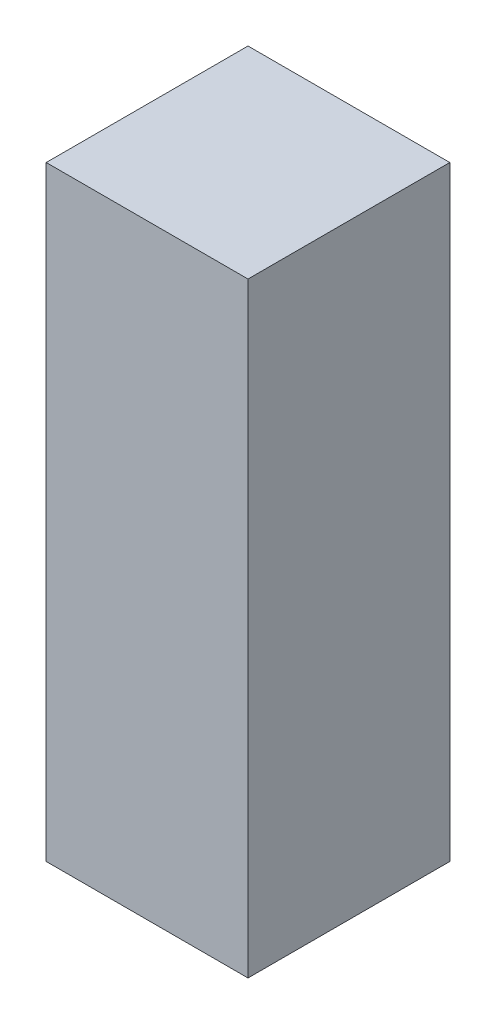
ISO-10303-21;
HEADER;
FILE_DESCRIPTION(('STEP AP214'),'2;1');
FILE_NAME('part.step','',(''),(''),'','','');
FILE_SCHEMA(('AUTOMOTIVE_DESIGN { 1 0 10303 214 1 1 1 1 }'));
ENDSEC;
DATA;
#1=APPLICATION_CONTEXT('core data for automotive mechanical design processes');
#2=APPLICATION_PROTOCOL_DEFINITION('international standard','automotive_design',2000,#1);
#3=PRODUCT_CONTEXT('',#1,'mechanical');
#4=PRODUCT('Part','Part','',(#3));
#5=PRODUCT_RELATED_PRODUCT_CATEGORY('part','',(#4));
#6=PRODUCT_DEFINITION_FORMATION('','',#4);
#7=PRODUCT_DEFINITION_CONTEXT('part definition',#1,'design');
#8=PRODUCT_DEFINITION('design','',#6,#7);
#9=PRODUCT_DEFINITION_SHAPE('','',#8);
#10=(LENGTH_UNIT() NAMED_UNIT(*) SI_UNIT(.MILLI.,.METRE.));
#11=(NAMED_UNIT(*) PLANE_ANGLE_UNIT() SI_UNIT($,.RADIAN.));
#12=(NAMED_UNIT(*) SI_UNIT($,.STERADIAN.) SOLID_ANGLE_UNIT());
#13=UNCERTAINTY_MEASURE_WITH_UNIT(LENGTH_MEASURE(1.E-05),#10,'distance_accuracy_value','');
#14=(GEOMETRIC_REPRESENTATION_CONTEXT(3) GLOBAL_UNCERTAINTY_ASSIGNED_CONTEXT((#13)) GLOBAL_UNIT_ASSIGNED_CONTEXT((#10,
#11,#12)) REPRESENTATION_CONTEXT('',''));
#15=CARTESIAN_POINT('',(0.,0.,0.));
#16=DIRECTION('',(0.,0.,1.));
#17=DIRECTION('',(1.,0.,0.));
#18=AXIS2_PLACEMENT_3D('',#15,#16,#17);
#19=CARTESIAN_POINT('',(-5000.,30000.,-5000.));
#20=DIRECTION('',(1.,0.,0.));
#21=DIRECTION('',(0.,0.,-1.));
#22=AXIS2_PLACEMENT_3D('',#19,#20,#21);
#23=PLANE('',#22);
#24=DIRECTION('',(0.,0.,1.));
#25=VECTOR('',#24,1.);
#26=CARTESIAN_POINT('',(-5000.,0.,-5000.));
#27=LINE('',#26,#25);
#28=CARTESIAN_POINT('',(-5000.,0.,-5000.));
#29=VERTEX_POINT('',#28);
#30=CARTESIAN_POINT('',(-5000.,0.,5000.));
#31=VERTEX_POINT('',#30);
#32=EDGE_CURVE('E107',#29,#31,#27,.T.);
#33=ORIENTED_EDGE('',*,*,#32,.T.);
#34=DIRECTION('',(0.,-1.,0.));
#35=VECTOR('',#34,1.);
#36=CARTESIAN_POINT('',(-5000.,30000.,5000.));
#37=LINE('',#36,#35);
#38=CARTESIAN_POINT('',(-5000.,30000.,5000.));
#39=VERTEX_POINT('',#38);
#40=EDGE_CURVE('E11',#39,#31,#37,.T.);
#41=ORIENTED_EDGE('',*,*,#40,.F.);
#42=DIRECTION('',(0.,0.,1.));
#43=VECTOR('',#42,1.);
#44=CARTESIAN_POINT('',(-5000.,30000.,-5000.));
#45=LINE('',#44,#43);
#46=CARTESIAN_POINT('',(-5000.,30000.,-5000.));
#47=VERTEX_POINT('',#46);
#48=EDGE_CURVE('E91',#47,#39,#45,.T.);
#49=ORIENTED_EDGE('',*,*,#48,.F.);
#50=DIRECTION('',(0.,-1.,0.));
#51=VECTOR('',#50,1.);
#52=CARTESIAN_POINT('',(-5000.,30000.,-5000.));
#53=LINE('',#52,#51);
#54=EDGE_CURVE('E103',#47,#29,#53,.T.);
#55=ORIENTED_EDGE('',*,*,#54,.T.);
#56=EDGE_LOOP('',(#33,#41,#49,#55));
#57=FACE_BOUND('',#56,.T.);
#58=ADVANCED_FACE('F39',(#57),#23,.F.);
#59=CARTESIAN_POINT('',(-5000.,30000.,5000.));
#60=DIRECTION('',(0.,0.,-1.));
#61=DIRECTION('',(-1.,0.,0.));
#62=AXIS2_PLACEMENT_3D('',#59,#60,#61);
#63=PLANE('',#62);
#64=DIRECTION('',(1.,0.,0.));
#65=VECTOR('',#64,1.);
#66=CARTESIAN_POINT('',(-5000.,0.,5000.));
#67=LINE('',#66,#65);
#68=CARTESIAN_POINT('',(5000.,0.,5000.));
#69=VERTEX_POINT('',#68);
#70=EDGE_CURVE('E96',#31,#69,#67,.T.);
#71=ORIENTED_EDGE('',*,*,#70,.T.);
#72=DIRECTION('',(0.,-1.,0.));
#73=VECTOR('',#72,1.);
#74=CARTESIAN_POINT('',(5000.,30000.,5000.));
#75=LINE('',#74,#73);
#76=CARTESIAN_POINT('',(5000.,30000.,5000.));
#77=VERTEX_POINT('',#76);
#78=EDGE_CURVE('E48',#77,#69,#75,.T.);
#79=ORIENTED_EDGE('',*,*,#78,.F.);
#80=DIRECTION('',(1.,0.,0.));
#81=VECTOR('',#80,1.);
#82=CARTESIAN_POINT('',(-5000.,30000.,5000.));
#83=LINE('',#82,#81);
#84=EDGE_CURVE('E86',#39,#77,#83,.T.);
#85=ORIENTED_EDGE('',*,*,#84,.F.);
#86=ORIENTED_EDGE('',*,*,#40,.T.);
#87=EDGE_LOOP('',(#71,#79,#85,#86));
#88=FACE_BOUND('',#87,.T.);
#89=ADVANCED_FACE('F95',(#88),#63,.F.);
#90=CARTESIAN_POINT('',(5000.,30000.,-5000.));
#91=DIRECTION('',(-1.,0.,0.));
#92=DIRECTION('',(0.,0.,1.));
#93=AXIS2_PLACEMENT_3D('',#90,#91,#92);
#94=PLANE('',#93);
#95=DIRECTION('',(0.,0.,-1.));
#96=VECTOR('',#95,1.);
#97=CARTESIAN_POINT('',(5000.,0.,-5000.));
#98=LINE('',#97,#96);
#99=CARTESIAN_POINT('',(5000.,0.,-5000.));
#100=VERTEX_POINT('',#99);
#101=EDGE_CURVE('E73',#69,#100,#98,.T.);
#102=ORIENTED_EDGE('',*,*,#101,.T.);
#103=DIRECTION('',(0.,-1.,0.));
#104=VECTOR('',#103,1.);
#105=CARTESIAN_POINT('',(5000.,30000.,-5000.));
#106=LINE('',#105,#104);
#107=CARTESIAN_POINT('',(5000.,30000.,-5000.));
#108=VERTEX_POINT('',#107);
#109=EDGE_CURVE('E98',#108,#100,#106,.T.);
#110=ORIENTED_EDGE('',*,*,#109,.F.);
#111=DIRECTION('',(0.,0.,-1.));
#112=VECTOR('',#111,1.);
#113=CARTESIAN_POINT('',(5000.,30000.,-5000.));
#114=LINE('',#113,#112);
#115=EDGE_CURVE('E89',#77,#108,#114,.T.);
#116=ORIENTED_EDGE('',*,*,#115,.F.);
#117=ORIENTED_EDGE('',*,*,#78,.T.);
#118=EDGE_LOOP('',(#102,#110,#116,#117));
#119=FACE_BOUND('',#118,.T.);
#120=ADVANCED_FACE('F99',(#119),#94,.F.);
#121=CARTESIAN_POINT('',(-5000.,30000.,-5000.));
#122=DIRECTION('',(0.,0.,1.));
#123=DIRECTION('',(1.,0.,0.));
#124=AXIS2_PLACEMENT_3D('',#121,#122,#123);
#125=PLANE('',#124);
#126=DIRECTION('',(-1.,0.,0.));
#127=VECTOR('',#126,1.);
#128=CARTESIAN_POINT('',(-5000.,0.,-5000.));
#129=LINE('',#128,#127);
#130=EDGE_CURVE('E79',#100,#29,#129,.T.);
#131=ORIENTED_EDGE('',*,*,#130,.T.);
#132=ORIENTED_EDGE('',*,*,#54,.F.);
#133=DIRECTION('',(-1.,0.,0.));
#134=VECTOR('',#133,1.);
#135=CARTESIAN_POINT('',(-5000.,30000.,-5000.));
#136=LINE('',#135,#134);
#137=EDGE_CURVE('E56',#108,#47,#136,.T.);
#138=ORIENTED_EDGE('',*,*,#137,.F.);
#139=ORIENTED_EDGE('',*,*,#109,.T.);
#140=EDGE_LOOP('',(#131,#132,#138,#139));
#141=FACE_BOUND('',#140,.T.);
#142=ADVANCED_FACE('F120',(#141),#125,.F.);
#143=CARTESIAN_POINT('',(0.,30000.,0.));
#144=DIRECTION('',(0.,1.,0.));
#145=DIRECTION('',(0.,0.,1.));
#146=AXIS2_PLACEMENT_3D('',#143,#144,#145);
#147=PLANE('',#146);
#148=ORIENTED_EDGE('',*,*,#48,.T.);
#149=ORIENTED_EDGE('',*,*,#84,.T.);
#150=ORIENTED_EDGE('',*,*,#115,.T.);
#151=ORIENTED_EDGE('',*,*,#137,.T.);
#152=EDGE_LOOP('',(#148,#149,#150,#151));
#153=FACE_BOUND('',#152,.T.);
#154=ADVANCED_FACE('F87',(#153),#147,.T.);
#155=CARTESIAN_POINT('',(0.,0.,0.));
#156=DIRECTION('',(0.,1.,0.));
#157=DIRECTION('',(0.,0.,1.));
#158=AXIS2_PLACEMENT_3D('',#155,#156,#157);
#159=PLANE('',#158);
#160=ORIENTED_EDGE('',*,*,#32,.F.);
#161=ORIENTED_EDGE('',*,*,#130,.F.);
#162=ORIENTED_EDGE('',*,*,#101,.F.);
#163=ORIENTED_EDGE('',*,*,#70,.F.);
#164=EDGE_LOOP('',(#160,#161,#162,#163));
#165=FACE_BOUND('',#164,.T.);
#166=ADVANCED_FACE('F123',(#165),#159,.F.);
#167=CLOSED_SHELL('',(#58,#89,#120,#142,#154,#166));
#168=MANIFOLD_SOLID_BREP('B2',#167);
#169=ADVANCED_BREP_SHAPE_REPRESENTATION('',(#18,#168),#14);
#170=SHAPE_DEFINITION_REPRESENTATION(#9,#169);
ENDSEC;
END-ISO-10303-21;
